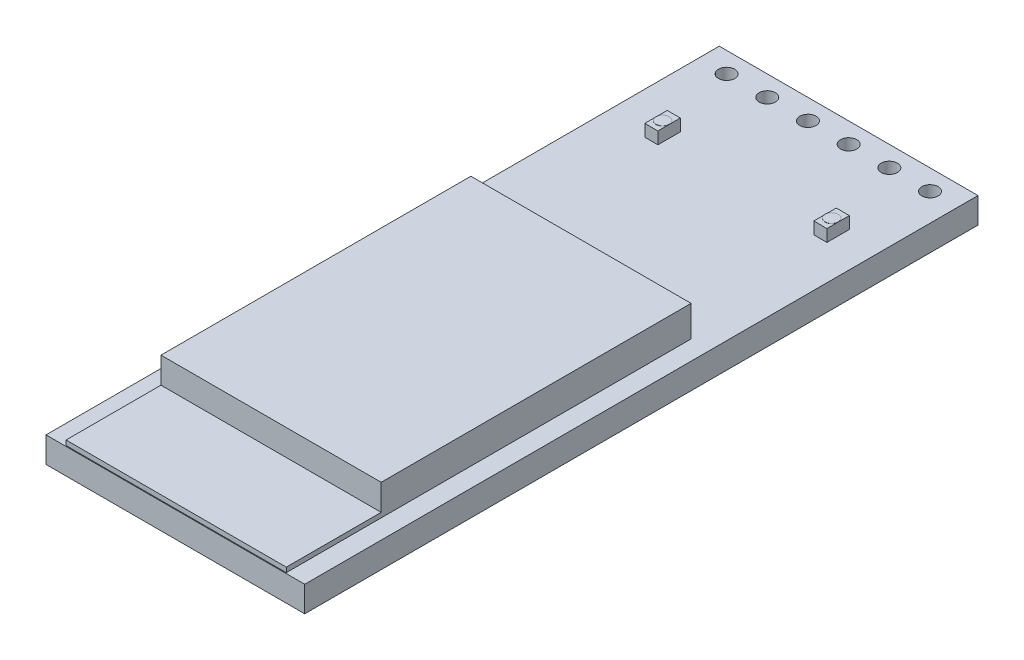
ISO-10303-21;
HEADER;
FILE_DESCRIPTION(('STEP AP214'),'2;1');
FILE_NAME('part.step','',(''),(''),'','','');
FILE_SCHEMA(('AUTOMOTIVE_DESIGN { 1 0 10303 214 1 1 1 1 }'));
ENDSEC;
DATA;
#1=APPLICATION_CONTEXT('core data for automotive mechanical design processes');
#2=APPLICATION_PROTOCOL_DEFINITION('international standard','automotive_design',2000,#1);
#3=PRODUCT_CONTEXT('',#1,'mechanical');
#4=PRODUCT('Part','Part','',(#3));
#5=PRODUCT_RELATED_PRODUCT_CATEGORY('part','',(#4));
#6=PRODUCT_DEFINITION_FORMATION('','',#4);
#7=PRODUCT_DEFINITION_CONTEXT('part definition',#1,'design');
#8=PRODUCT_DEFINITION('design','',#6,#7);
#9=PRODUCT_DEFINITION_SHAPE('','',#8);
#10=(LENGTH_UNIT() NAMED_UNIT(*) SI_UNIT(.MILLI.,.METRE.));
#11=(NAMED_UNIT(*) PLANE_ANGLE_UNIT() SI_UNIT($,.RADIAN.));
#12=(NAMED_UNIT(*) SI_UNIT($,.STERADIAN.) SOLID_ANGLE_UNIT());
#13=UNCERTAINTY_MEASURE_WITH_UNIT(LENGTH_MEASURE(1.E-05),#10,'distance_accuracy_value','');
#14=(GEOMETRIC_REPRESENTATION_CONTEXT(3) GLOBAL_UNCERTAINTY_ASSIGNED_CONTEXT((#13)) GLOBAL_UNIT_ASSIGNED_CONTEXT((#10,
#11,#12)) REPRESENTATION_CONTEXT('',''));
#15=CARTESIAN_POINT('',(0.,0.,0.));
#16=DIRECTION('',(0.,0.,1.));
#17=DIRECTION('',(1.,0.,0.));
#18=AXIS2_PLACEMENT_3D('',#15,#16,#17);
#19=CARTESIAN_POINT('',(-35.1697638099961,1.5501,0.));
#20=DIRECTION('',(0.,1.,0.));
#21=DIRECTION('',(0.,0.,1.));
#22=AXIS2_PLACEMENT_3D('',#19,#20,#21);
#23=PLANE('',#22);
#24=CARTESIAN_POINT('',(5.48720000000001,1.5501,-14.4685));
#25=DIRECTION('',(0.,1.,0.));
#26=DIRECTION('',(0.,0.,1.));
#27=AXIS2_PLACEMENT_3D('',#24,#25,#26);
#28=CIRCLE('',#27,0.409999999999999);
#29=CARTESIAN_POINT('',(5.89720000000001,1.5501,-14.4685));
#30=VERTEX_POINT('',#29);
#31=CARTESIAN_POINT('',(5.0772,1.5501,-14.4685));
#32=VERTEX_POINT('',#31);
#33=EDGE_CURVE('E48',#30,#32,#28,.T.);
#34=ORIENTED_EDGE('',*,*,#33,.F.);
#35=DIRECTION('',(0.,0.,1.));
#36=VECTOR('',#35,1.);
#37=CARTESIAN_POINT('',(5.89720000000001,1.5501,0.));
#38=LINE('',#37,#36);
#39=CARTESIAN_POINT('',(5.89720000000001,1.5501,-15.1685));
#40=VERTEX_POINT('',#39);
#41=EDGE_CURVE('E175',#40,#30,#38,.T.);
#42=ORIENTED_EDGE('',*,*,#41,.F.);
#43=DIRECTION('',(1.,0.,0.));
#44=VECTOR('',#43,1.);
#45=CARTESIAN_POINT('',(-35.1697638099961,1.5501,-15.1685));
#46=LINE('',#45,#44);
#47=CARTESIAN_POINT('',(5.07720000000001,1.5501,-15.1685));
#48=VERTEX_POINT('',#47);
#49=EDGE_CURVE('E185',#48,#40,#46,.T.);
#50=ORIENTED_EDGE('',*,*,#49,.F.);
#51=DIRECTION('',(0.,0.,1.));
#52=VECTOR('',#51,1.);
#53=CARTESIAN_POINT('',(5.0772,1.5501,0.));
#54=LINE('',#53,#52);
#55=EDGE_CURVE('E195',#48,#32,#54,.T.);
#56=ORIENTED_EDGE('',*,*,#55,.T.);
#57=EDGE_LOOP('',(#34,#42,#50,#56));
#58=FACE_BOUND('',#57,.T.);
#59=ADVANCED_FACE('F37',(#58),#23,.T.);
#60=CARTESIAN_POINT('',(-35.1697638099961,1.5501,0.));
#61=DIRECTION('',(0.,1.,0.));
#62=DIRECTION('',(0.,0.,1.));
#63=AXIS2_PLACEMENT_3D('',#60,#61,#62);
#64=PLANE('',#63);
#65=CARTESIAN_POINT('',(-5.06720000000002,1.5501,-14.4685));
#66=DIRECTION('',(0.,1.,0.));
#67=DIRECTION('',(0.,0.,1.));
#68=AXIS2_PLACEMENT_3D('',#65,#66,#67);
#69=CIRCLE('',#68,0.410000000000002);
#70=CARTESIAN_POINT('',(-4.65720000000001,1.5501,-14.4685));
#71=VERTEX_POINT('',#70);
#72=CARTESIAN_POINT('',(-5.47720000000002,1.5501,-14.4685));
#73=VERTEX_POINT('',#72);
#74=EDGE_CURVE('E554',#71,#73,#69,.T.);
#75=ORIENTED_EDGE('',*,*,#74,.F.);
#76=DIRECTION('',(0.,0.,1.));
#77=VECTOR('',#76,1.);
#78=CARTESIAN_POINT('',(-4.65720000000001,1.5501,0.));
#79=LINE('',#78,#77);
#80=CARTESIAN_POINT('',(-4.65720000000001,1.5501,-15.1685));
#81=VERTEX_POINT('',#80);
#82=EDGE_CURVE('E530',#81,#71,#79,.T.);
#83=ORIENTED_EDGE('',*,*,#82,.F.);
#84=DIRECTION('',(1.,0.,0.));
#85=VECTOR('',#84,1.);
#86=CARTESIAN_POINT('',(-35.1697638099961,1.5501,-15.1685));
#87=LINE('',#86,#85);
#88=CARTESIAN_POINT('',(-5.47720000000001,1.5501,-15.1685));
#89=VERTEX_POINT('',#88);
#90=EDGE_CURVE('E527',#89,#81,#87,.T.);
#91=ORIENTED_EDGE('',*,*,#90,.F.);
#92=DIRECTION('',(0.,0.,1.));
#93=VECTOR('',#92,1.);
#94=CARTESIAN_POINT('',(-5.47720000000003,1.5501,0.));
#95=LINE('',#94,#93);
#96=EDGE_CURVE('E523',#89,#73,#95,.T.);
#97=ORIENTED_EDGE('',*,*,#96,.T.);
#98=EDGE_LOOP('',(#75,#83,#91,#97));
#99=FACE_BOUND('',#98,.T.);
#100=ADVANCED_FACE('F215',(#99),#64,.T.);
#101=CARTESIAN_POINT('',(8.07720000000002,0.8001,21.0185));
#102=DIRECTION('',(0.,1.,0.));
#103=DIRECTION('',(0.,0.,1.));
#104=AXIS2_PLACEMENT_3D('',#101,#102,#103);
#105=PLANE('',#104);
#106=DIRECTION('',(0.,0.,1.));
#107=VECTOR('',#106,1.);
#108=CARTESIAN_POINT('',(5.89720000000001,0.8001,0.));
#109=LINE('',#108,#107);
#110=CARTESIAN_POINT('',(5.89720000000001,0.8001,-15.1685));
#111=VERTEX_POINT('',#110);
#112=CARTESIAN_POINT('',(5.89720000000001,0.8001,-13.7685));
#113=VERTEX_POINT('',#112);
#114=EDGE_CURVE('E546',#111,#113,#109,.T.);
#115=ORIENTED_EDGE('',*,*,#114,.T.);
#116=DIRECTION('',(1.,0.,0.));
#117=VECTOR('',#116,1.);
#118=CARTESIAN_POINT('',(-35.1697638099961,0.8001,-13.7684999999999));
#119=LINE('',#118,#117);
#120=CARTESIAN_POINT('',(5.0772,0.8001,-13.7685));
#121=VERTEX_POINT('',#120);
#122=EDGE_CURVE('E191',#121,#113,#119,.T.);
#123=ORIENTED_EDGE('',*,*,#122,.F.);
#124=DIRECTION('',(0.,0.,1.));
#125=VECTOR('',#124,1.);
#126=CARTESIAN_POINT('',(5.0772,0.8001,0.));
#127=LINE('',#126,#125);
#128=CARTESIAN_POINT('',(5.07720000000001,0.8001,-15.1685));
#129=VERTEX_POINT('',#128);
#130=EDGE_CURVE('E540',#129,#121,#127,.T.);
#131=ORIENTED_EDGE('',*,*,#130,.F.);
#132=DIRECTION('',(1.,0.,0.));
#133=VECTOR('',#132,1.);
#134=CARTESIAN_POINT('',(-35.1697638099961,0.8001,-15.1685));
#135=LINE('',#134,#133);
#136=EDGE_CURVE('E543',#129,#111,#135,.T.);
#137=ORIENTED_EDGE('',*,*,#136,.T.);
#138=EDGE_LOOP('',(#115,#123,#131,#137));
#139=FACE_BOUND('',#138,.T.);
#140=DIRECTION('',(0.,0.,1.));
#141=VECTOR('',#140,1.);
#142=CARTESIAN_POINT('',(-4.65720000000001,0.8001,0.));
#143=LINE('',#142,#141);
#144=CARTESIAN_POINT('',(-4.65720000000001,0.8001,-15.1685));
#145=VERTEX_POINT('',#144);
#146=CARTESIAN_POINT('',(-4.65720000000001,0.8001,-13.7685));
#147=VERTEX_POINT('',#146);
#148=EDGE_CURVE('E518',#145,#147,#143,.T.);
#149=ORIENTED_EDGE('',*,*,#148,.T.);
#150=DIRECTION('',(1.,0.,0.));
#151=VECTOR('',#150,1.);
#152=CARTESIAN_POINT('',(-35.1697638099961,0.8001,-13.7685));
#153=LINE('',#152,#151);
#154=CARTESIAN_POINT('',(-5.47720000000002,0.8001,-13.7685));
#155=VERTEX_POINT('',#154);
#156=EDGE_CURVE('E508',#155,#147,#153,.T.);
#157=ORIENTED_EDGE('',*,*,#156,.F.);
#158=DIRECTION('',(0.,0.,1.));
#159=VECTOR('',#158,1.);
#160=CARTESIAN_POINT('',(-5.47720000000003,0.8001,0.));
#161=LINE('',#160,#159);
#162=CARTESIAN_POINT('',(-5.47720000000001,0.8001,-15.1685));
#163=VERTEX_POINT('',#162);
#164=EDGE_CURVE('E512',#163,#155,#161,.T.);
#165=ORIENTED_EDGE('',*,*,#164,.F.);
#166=DIRECTION('',(1.,0.,0.));
#167=VECTOR('',#166,1.);
#168=CARTESIAN_POINT('',(-35.1697638099961,0.8001,-15.1685));
#169=LINE('',#168,#167);
#170=EDGE_CURVE('E515',#163,#145,#169,.T.);
#171=ORIENTED_EDGE('',*,*,#170,.T.);
#172=EDGE_LOOP('',(#149,#157,#165,#171));
#173=FACE_BOUND('',#172,.T.);
#174=DIRECTION('',(0.,0.,-1.));
#175=VECTOR('',#174,1.);
#176=CARTESIAN_POINT('',(8.07720000000002,0.8001,-21.0185));
#177=LINE('',#176,#175);
#178=CARTESIAN_POINT('',(8.07720000000002,0.8001,21.0185));
#179=VERTEX_POINT('',#178);
#180=CARTESIAN_POINT('',(8.07720000000002,0.8001,-21.0185));
#181=VERTEX_POINT('',#180);
#182=EDGE_CURVE('E363',#179,#181,#177,.T.);
#183=ORIENTED_EDGE('',*,*,#182,.T.);
#184=DIRECTION('',(-1.,0.,0.));
#185=VECTOR('',#184,1.);
#186=CARTESIAN_POINT('',(-8.07720000000002,0.8001,-21.0185));
#187=LINE('',#186,#185);
#188=CARTESIAN_POINT('',(-8.07720000000002,0.8001,-21.0185));
#189=VERTEX_POINT('',#188);
#190=EDGE_CURVE('E445',#181,#189,#187,.T.);
#191=ORIENTED_EDGE('',*,*,#190,.T.);
#192=DIRECTION('',(0.,0.,1.));
#193=VECTOR('',#192,1.);
#194=CARTESIAN_POINT('',(-8.07720000000002,0.8001,-21.0185));
#195=LINE('',#194,#193);
#196=CARTESIAN_POINT('',(-8.07720000000002,0.8001,21.0185));
#197=VERTEX_POINT('',#196);
#198=EDGE_CURVE('E357',#189,#197,#195,.T.);
#199=ORIENTED_EDGE('',*,*,#198,.T.);
#200=DIRECTION('',(1.,0.,0.));
#201=VECTOR('',#200,1.);
#202=CARTESIAN_POINT('',(-8.07720000000002,0.8001,21.0185));
#203=LINE('',#202,#201);
#204=EDGE_CURVE('E370',#197,#179,#203,.T.);
#205=ORIENTED_EDGE('',*,*,#204,.T.);
#206=EDGE_LOOP('',(#183,#191,#199,#205));
#207=FACE_BOUND('',#206,.T.);
#208=CARTESIAN_POINT('',(-6.35,0.8001,-19.7485));
#209=DIRECTION('',(0.,1.,0.));
#210=DIRECTION('',(0.,0.,1.));
#211=AXIS2_PLACEMENT_3D('',#208,#209,#210);
#212=CIRCLE('',#211,0.508000000000001);
#213=CARTESIAN_POINT('',(-6.35,0.8001,-19.2405));
#214=VERTEX_POINT('',#213);
#215=EDGE_CURVE('E435',#214,#214,#212,.T.);
#216=ORIENTED_EDGE('',*,*,#215,.F.);
#217=EDGE_LOOP('',(#216));
#218=FACE_BOUND('',#217,.T.);
#219=CARTESIAN_POINT('',(-3.81,0.8001,-19.7485));
#220=DIRECTION('',(0.,1.,0.));
#221=DIRECTION('',(0.,0.,1.));
#222=AXIS2_PLACEMENT_3D('',#219,#220,#221);
#223=CIRCLE('',#222,0.508);
#224=CARTESIAN_POINT('',(-3.81,0.8001,-19.2405));
#225=VERTEX_POINT('',#224);
#226=EDGE_CURVE('E429',#225,#225,#223,.T.);
#227=ORIENTED_EDGE('',*,*,#226,.F.);
#228=EDGE_LOOP('',(#227));
#229=FACE_BOUND('',#228,.T.);
#230=CARTESIAN_POINT('',(-1.27,0.8001,-19.7485));
#231=DIRECTION('',(0.,1.,0.));
#232=DIRECTION('',(0.,0.,1.));
#233=AXIS2_PLACEMENT_3D('',#230,#231,#232);
#234=CIRCLE('',#233,0.508);
#235=CARTESIAN_POINT('',(-1.27,0.8001,-19.2405));
#236=VERTEX_POINT('',#235);
#237=EDGE_CURVE('E423',#236,#236,#234,.T.);
#238=ORIENTED_EDGE('',*,*,#237,.F.);
#239=EDGE_LOOP('',(#238));
#240=FACE_BOUND('',#239,.T.);
#241=CARTESIAN_POINT('',(1.27,0.8001,-19.7485));
#242=DIRECTION('',(0.,1.,0.));
#243=DIRECTION('',(0.,0.,1.));
#244=AXIS2_PLACEMENT_3D('',#241,#242,#243);
#245=CIRCLE('',#244,0.508);
#246=CARTESIAN_POINT('',(1.27,0.8001,-19.2405));
#247=VERTEX_POINT('',#246);
#248=EDGE_CURVE('E417',#247,#247,#245,.T.);
#249=ORIENTED_EDGE('',*,*,#248,.F.);
#250=EDGE_LOOP('',(#249));
#251=FACE_BOUND('',#250,.T.);
#252=CARTESIAN_POINT('',(3.81,0.8001,-19.7485));
#253=DIRECTION('',(0.,1.,0.));
#254=DIRECTION('',(0.,0.,1.));
#255=AXIS2_PLACEMENT_3D('',#252,#253,#254);
#256=CIRCLE('',#255,0.508000000000001);
#257=CARTESIAN_POINT('',(3.81,0.8001,-19.2405));
#258=VERTEX_POINT('',#257);
#259=EDGE_CURVE('E411',#258,#258,#256,.T.);
#260=ORIENTED_EDGE('',*,*,#259,.F.);
#261=EDGE_LOOP('',(#260));
#262=FACE_BOUND('',#261,.T.);
#263=CARTESIAN_POINT('',(6.35,0.8001,-19.7485));
#264=DIRECTION('',(0.,1.,0.));
#265=DIRECTION('',(0.,0.,1.));
#266=AXIS2_PLACEMENT_3D('',#263,#264,#265);
#267=CIRCLE('',#266,0.508000000000001);
#268=CARTESIAN_POINT('',(6.35,0.8001,-19.2405));
#269=VERTEX_POINT('',#268);
#270=EDGE_CURVE('E407',#269,#269,#267,.T.);
#271=ORIENTED_EDGE('',*,*,#270,.F.);
#272=EDGE_LOOP('',(#271));
#273=FACE_BOUND('',#272,.T.);
#274=DIRECTION('',(0.,0.,1.));
#275=VECTOR('',#274,1.);
#276=CARTESIAN_POINT('',(6.875,0.8001,0.));
#277=LINE('',#276,#275);
#278=CARTESIAN_POINT('',(6.875,0.8001,-4.30650000000001));
#279=VERTEX_POINT('',#278);
#280=CARTESIAN_POINT('',(6.875,0.8001,20.9685));
#281=VERTEX_POINT('',#280);
#282=EDGE_CURVE('E388',#279,#281,#277,.T.);
#283=ORIENTED_EDGE('',*,*,#282,.T.);
#284=DIRECTION('',(1.,0.,0.));
#285=VECTOR('',#284,1.);
#286=CARTESIAN_POINT('',(-35.1697638099961,0.8001,20.9685));
#287=LINE('',#286,#285);
#288=CARTESIAN_POINT('',(-6.875,0.8001,20.9685));
#289=VERTEX_POINT('',#288);
#290=EDGE_CURVE('E385',#289,#281,#287,.T.);
#291=ORIENTED_EDGE('',*,*,#290,.F.);
#292=DIRECTION('',(0.,0.,1.));
#293=VECTOR('',#292,1.);
#294=CARTESIAN_POINT('',(-6.875,0.8001,0.));
#295=LINE('',#294,#293);
#296=CARTESIAN_POINT('',(-6.875,0.8001,-4.30650000000001));
#297=VERTEX_POINT('',#296);
#298=EDGE_CURVE('E395',#297,#289,#295,.T.);
#299=ORIENTED_EDGE('',*,*,#298,.F.);
#300=DIRECTION('',(1.,0.,0.));
#301=VECTOR('',#300,1.);
#302=CARTESIAN_POINT('',(-35.1697638099961,0.8001,-4.3065));
#303=LINE('',#302,#301);
#304=EDGE_CURVE('E392',#297,#279,#303,.T.);
#305=ORIENTED_EDGE('',*,*,#304,.T.);
#306=EDGE_LOOP('',(#283,#291,#299,#305));
#307=FACE_BOUND('',#306,.T.);
#308=ADVANCED_FACE('F221',(#139,#173,#207,#218,#229,#240,#251,#262,#273,#307),#105,.T.);
#309=CARTESIAN_POINT('',(8.07720000000002,0.8001,-21.0185));
#310=DIRECTION('',(-1.,0.,0.));
#311=DIRECTION('',(0.,0.,1.));
#312=AXIS2_PLACEMENT_3D('',#309,#310,#311);
#313=PLANE('',#312);
#314=DIRECTION('',(0.,0.,-1.));
#315=VECTOR('',#314,1.);
#316=CARTESIAN_POINT('',(8.07720000000002,-0.8001,-21.0185));
#317=LINE('',#316,#315);
#318=CARTESIAN_POINT('',(8.07720000000002,-0.8001,21.0185));
#319=VERTEX_POINT('',#318);
#320=CARTESIAN_POINT('',(8.07720000000002,-0.8001,-21.0185));
#321=VERTEX_POINT('',#320);
#322=EDGE_CURVE('E353',#319,#321,#317,.T.);
#323=ORIENTED_EDGE('',*,*,#322,.T.);
#324=DIRECTION('',(0.,-1.,0.));
#325=VECTOR('',#324,1.);
#326=CARTESIAN_POINT('',(8.07720000000002,0.8001,-21.0185));
#327=LINE('',#326,#325);
#328=EDGE_CURVE('E347',#181,#321,#327,.T.);
#329=ORIENTED_EDGE('',*,*,#328,.F.);
#330=ORIENTED_EDGE('',*,*,#182,.F.);
#331=DIRECTION('',(0.,-1.,0.));
#332=VECTOR('',#331,1.);
#333=CARTESIAN_POINT('',(8.07720000000002,0.8001,21.0185));
#334=LINE('',#333,#332);
#335=EDGE_CURVE('E367',#179,#319,#334,.T.);
#336=ORIENTED_EDGE('',*,*,#335,.T.);
#337=EDGE_LOOP('',(#323,#329,#330,#336));
#338=FACE_BOUND('',#337,.T.);
#339=ADVANCED_FACE('F39',(#338),#313,.F.);
#340=CARTESIAN_POINT('',(-8.07720000000002,0.8001,-21.0185));
#341=DIRECTION('',(0.,0.,1.));
#342=DIRECTION('',(1.,0.,0.));
#343=AXIS2_PLACEMENT_3D('',#340,#341,#342);
#344=PLANE('',#343);
#345=DIRECTION('',(-1.,0.,0.));
#346=VECTOR('',#345,1.);
#347=CARTESIAN_POINT('',(-8.07720000000002,-0.8001,-21.0185));
#348=LINE('',#347,#346);
#349=CARTESIAN_POINT('',(-8.07720000000002,-0.8001,-21.0185));
#350=VERTEX_POINT('',#349);
#351=EDGE_CURVE('E342',#321,#350,#348,.T.);
#352=ORIENTED_EDGE('',*,*,#351,.T.);
#353=DIRECTION('',(0.,-1.,0.));
#354=VECTOR('',#353,1.);
#355=CARTESIAN_POINT('',(-8.07720000000002,0.8001,-21.0185));
#356=LINE('',#355,#354);
#357=EDGE_CURVE('E344',#189,#350,#356,.T.);
#358=ORIENTED_EDGE('',*,*,#357,.F.);
#359=ORIENTED_EDGE('',*,*,#190,.F.);
#360=ORIENTED_EDGE('',*,*,#328,.T.);
#361=EDGE_LOOP('',(#352,#358,#359,#360));
#362=FACE_BOUND('',#361,.T.);
#363=ADVANCED_FACE('F332',(#362),#344,.F.);
#364=CARTESIAN_POINT('',(-8.07720000000002,0.8001,-21.0185));
#365=DIRECTION('',(1.,0.,0.));
#366=DIRECTION('',(0.,0.,-1.));
#367=AXIS2_PLACEMENT_3D('',#364,#365,#366);
#368=PLANE('',#367);
#369=DIRECTION('',(0.,0.,1.));
#370=VECTOR('',#369,1.);
#371=CARTESIAN_POINT('',(-8.07720000000002,-0.8001,-21.0185));
#372=LINE('',#371,#370);
#373=CARTESIAN_POINT('',(-8.07720000000002,-0.8001,21.0185));
#374=VERTEX_POINT('',#373);
#375=EDGE_CURVE('E352',#350,#374,#372,.T.);
#376=ORIENTED_EDGE('',*,*,#375,.T.);
#377=DIRECTION('',(0.,-1.,0.));
#378=VECTOR('',#377,1.);
#379=CARTESIAN_POINT('',(-8.07720000000002,0.8001,21.0185));
#380=LINE('',#379,#378);
#381=EDGE_CURVE('E358',#197,#374,#380,.T.);
#382=ORIENTED_EDGE('',*,*,#381,.F.);
#383=ORIENTED_EDGE('',*,*,#198,.F.);
#384=ORIENTED_EDGE('',*,*,#357,.T.);
#385=EDGE_LOOP('',(#376,#382,#383,#384));
#386=FACE_BOUND('',#385,.T.);
#387=ADVANCED_FACE('F329',(#386),#368,.F.);
#388=CARTESIAN_POINT('',(-8.07720000000002,0.8001,21.0185));
#389=DIRECTION('',(0.,0.,-1.));
#390=DIRECTION('',(-1.,0.,0.));
#391=AXIS2_PLACEMENT_3D('',#388,#389,#390);
#392=PLANE('',#391);
#393=DIRECTION('',(1.,0.,0.));
#394=VECTOR('',#393,1.);
#395=CARTESIAN_POINT('',(-8.07720000000002,-0.8001,21.0185));
#396=LINE('',#395,#394);
#397=EDGE_CURVE('E361',#374,#319,#396,.T.);
#398=ORIENTED_EDGE('',*,*,#397,.T.);
#399=ORIENTED_EDGE('',*,*,#335,.F.);
#400=ORIENTED_EDGE('',*,*,#204,.F.);
#401=ORIENTED_EDGE('',*,*,#381,.T.);
#402=EDGE_LOOP('',(#398,#399,#400,#401));
#403=FACE_BOUND('',#402,.T.);
#404=ADVANCED_FACE('F325',(#403),#392,.F.);
#405=CARTESIAN_POINT('',(8.07720000000002,-0.8001,21.0185));
#406=DIRECTION('',(0.,1.,0.));
#407=DIRECTION('',(0.,0.,1.));
#408=AXIS2_PLACEMENT_3D('',#405,#406,#407);
#409=PLANE('',#408);
#410=CARTESIAN_POINT('',(6.35,-0.8001,-19.7485));
#411=DIRECTION('',(0.,1.,0.));
#412=DIRECTION('',(0.,0.,1.));
#413=AXIS2_PLACEMENT_3D('',#410,#411,#412);
#414=CIRCLE('',#413,0.508000000000001);
#415=CARTESIAN_POINT('',(6.35,-0.8001,-19.2405));
#416=VERTEX_POINT('',#415);
#417=EDGE_CURVE('E408',#416,#416,#414,.T.);
#418=ORIENTED_EDGE('',*,*,#417,.T.);
#419=EDGE_LOOP('',(#418));
#420=FACE_BOUND('',#419,.T.);
#421=CARTESIAN_POINT('',(3.81,-0.8001,-19.7485));
#422=DIRECTION('',(0.,1.,0.));
#423=DIRECTION('',(0.,0.,1.));
#424=AXIS2_PLACEMENT_3D('',#421,#422,#423);
#425=CIRCLE('',#424,0.508000000000001);
#426=CARTESIAN_POINT('',(3.81,-0.8001,-19.2405));
#427=VERTEX_POINT('',#426);
#428=EDGE_CURVE('E414',#427,#427,#425,.T.);
#429=ORIENTED_EDGE('',*,*,#428,.T.);
#430=EDGE_LOOP('',(#429));
#431=FACE_BOUND('',#430,.T.);
#432=CARTESIAN_POINT('',(1.27,-0.8001,-19.7485));
#433=DIRECTION('',(0.,1.,0.));
#434=DIRECTION('',(0.,0.,1.));
#435=AXIS2_PLACEMENT_3D('',#432,#433,#434);
#436=CIRCLE('',#435,0.508);
#437=CARTESIAN_POINT('',(1.27,-0.8001,-19.2405));
#438=VERTEX_POINT('',#437);
#439=EDGE_CURVE('E420',#438,#438,#436,.T.);
#440=ORIENTED_EDGE('',*,*,#439,.T.);
#441=EDGE_LOOP('',(#440));
#442=FACE_BOUND('',#441,.T.);
#443=CARTESIAN_POINT('',(-1.27,-0.8001,-19.7485));
#444=DIRECTION('',(0.,1.,0.));
#445=DIRECTION('',(0.,0.,1.));
#446=AXIS2_PLACEMENT_3D('',#443,#444,#445);
#447=CIRCLE('',#446,0.508);
#448=CARTESIAN_POINT('',(-1.27,-0.8001,-19.2405));
#449=VERTEX_POINT('',#448);
#450=EDGE_CURVE('E426',#449,#449,#447,.T.);
#451=ORIENTED_EDGE('',*,*,#450,.T.);
#452=EDGE_LOOP('',(#451));
#453=FACE_BOUND('',#452,.T.);
#454=CARTESIAN_POINT('',(-3.81,-0.8001,-19.7485));
#455=DIRECTION('',(0.,1.,0.));
#456=DIRECTION('',(0.,0.,1.));
#457=AXIS2_PLACEMENT_3D('',#454,#455,#456);
#458=CIRCLE('',#457,0.508);
#459=CARTESIAN_POINT('',(-3.81,-0.8001,-19.2405));
#460=VERTEX_POINT('',#459);
#461=EDGE_CURVE('E432',#460,#460,#458,.T.);
#462=ORIENTED_EDGE('',*,*,#461,.T.);
#463=EDGE_LOOP('',(#462));
#464=FACE_BOUND('',#463,.T.);
#465=CARTESIAN_POINT('',(-6.35,-0.8001,-19.7485));
#466=DIRECTION('',(0.,1.,0.));
#467=DIRECTION('',(0.,0.,1.));
#468=AXIS2_PLACEMENT_3D('',#465,#466,#467);
#469=CIRCLE('',#468,0.508000000000001);
#470=CARTESIAN_POINT('',(-6.35,-0.8001,-19.2405));
#471=VERTEX_POINT('',#470);
#472=EDGE_CURVE('E438',#471,#471,#469,.T.);
#473=ORIENTED_EDGE('',*,*,#472,.T.);
#474=EDGE_LOOP('',(#473));
#475=FACE_BOUND('',#474,.T.);
#476=ORIENTED_EDGE('',*,*,#322,.F.);
#477=ORIENTED_EDGE('',*,*,#397,.F.);
#478=ORIENTED_EDGE('',*,*,#375,.F.);
#479=ORIENTED_EDGE('',*,*,#351,.F.);
#480=EDGE_LOOP('',(#476,#477,#478,#479));
#481=FACE_BOUND('',#480,.T.);
#482=ADVANCED_FACE('F318',(#420,#431,#442,#453,#464,#475,#481),#409,.F.);
#483=CARTESIAN_POINT('',(-6.35,-0.8001,-19.7485));
#484=DIRECTION('',(0.,1.,0.));
#485=DIRECTION('',(0.,0.,1.));
#486=AXIS2_PLACEMENT_3D('',#483,#484,#485);
#487=CYLINDRICAL_SURFACE('',#486,0.508000000000001);
#488=ORIENTED_EDGE('',*,*,#472,.F.);
#489=EDGE_LOOP('',(#488));
#490=FACE_BOUND('',#489,.T.);
#491=ORIENTED_EDGE('',*,*,#215,.T.);
#492=EDGE_LOOP('',(#491));
#493=FACE_BOUND('',#492,.T.);
#494=ADVANCED_FACE('F314',(#490,#493),#487,.F.);
#495=CARTESIAN_POINT('',(-3.81,-0.8001,-19.7485));
#496=DIRECTION('',(0.,1.,0.));
#497=DIRECTION('',(0.,0.,1.));
#498=AXIS2_PLACEMENT_3D('',#495,#496,#497);
#499=CYLINDRICAL_SURFACE('',#498,0.508);
#500=ORIENTED_EDGE('',*,*,#461,.F.);
#501=EDGE_LOOP('',(#500));
#502=FACE_BOUND('',#501,.T.);
#503=ORIENTED_EDGE('',*,*,#226,.T.);
#504=EDGE_LOOP('',(#503));
#505=FACE_BOUND('',#504,.T.);
#506=ADVANCED_FACE('F310',(#502,#505),#499,.F.);
#507=CARTESIAN_POINT('',(-1.27,-0.8001,-19.7485));
#508=DIRECTION('',(0.,1.,0.));
#509=DIRECTION('',(0.,0.,1.));
#510=AXIS2_PLACEMENT_3D('',#507,#508,#509);
#511=CYLINDRICAL_SURFACE('',#510,0.508);
#512=ORIENTED_EDGE('',*,*,#450,.F.);
#513=EDGE_LOOP('',(#512));
#514=FACE_BOUND('',#513,.T.);
#515=ORIENTED_EDGE('',*,*,#237,.T.);
#516=EDGE_LOOP('',(#515));
#517=FACE_BOUND('',#516,.T.);
#518=ADVANCED_FACE('F306',(#514,#517),#511,.F.);
#519=CARTESIAN_POINT('',(1.27,-0.8001,-19.7485));
#520=DIRECTION('',(0.,1.,0.));
#521=DIRECTION('',(0.,0.,1.));
#522=AXIS2_PLACEMENT_3D('',#519,#520,#521);
#523=CYLINDRICAL_SURFACE('',#522,0.508);
#524=ORIENTED_EDGE('',*,*,#439,.F.);
#525=EDGE_LOOP('',(#524));
#526=FACE_BOUND('',#525,.T.);
#527=ORIENTED_EDGE('',*,*,#248,.T.);
#528=EDGE_LOOP('',(#527));
#529=FACE_BOUND('',#528,.T.);
#530=ADVANCED_FACE('F302',(#526,#529),#523,.F.);
#531=CARTESIAN_POINT('',(3.81,-0.8001,-19.7485));
#532=DIRECTION('',(0.,1.,0.));
#533=DIRECTION('',(0.,0.,1.));
#534=AXIS2_PLACEMENT_3D('',#531,#532,#533);
#535=CYLINDRICAL_SURFACE('',#534,0.508000000000001);
#536=ORIENTED_EDGE('',*,*,#428,.F.);
#537=EDGE_LOOP('',(#536));
#538=FACE_BOUND('',#537,.T.);
#539=ORIENTED_EDGE('',*,*,#259,.T.);
#540=EDGE_LOOP('',(#539));
#541=FACE_BOUND('',#540,.T.);
#542=ADVANCED_FACE('F298',(#538,#541),#535,.F.);
#543=CARTESIAN_POINT('',(6.35,-0.8001,-19.7485));
#544=DIRECTION('',(0.,1.,0.));
#545=DIRECTION('',(0.,0.,1.));
#546=AXIS2_PLACEMENT_3D('',#543,#544,#545);
#547=CYLINDRICAL_SURFACE('',#546,0.508000000000001);
#548=ORIENTED_EDGE('',*,*,#417,.F.);
#549=EDGE_LOOP('',(#548));
#550=FACE_BOUND('',#549,.T.);
#551=ORIENTED_EDGE('',*,*,#270,.T.);
#552=EDGE_LOOP('',(#551));
#553=FACE_BOUND('',#552,.T.);
#554=ADVANCED_FACE('F294',(#550,#553),#547,.F.);
#555=CARTESIAN_POINT('',(-35.1697638099961,1.1001,20.9685));
#556=DIRECTION('',(0.,0.,-1.));
#557=DIRECTION('',(-1.,0.,0.));
#558=AXIS2_PLACEMENT_3D('',#555,#556,#557);
#559=PLANE('',#558);
#560=ORIENTED_EDGE('',*,*,#290,.T.);
#561=DIRECTION('',(0.,-1.,0.));
#562=VECTOR('',#561,1.);
#563=CARTESIAN_POINT('',(6.875,1.1001,20.9685));
#564=LINE('',#563,#562);
#565=CARTESIAN_POINT('',(6.875,1.1001,20.9685));
#566=VERTEX_POINT('',#565);
#567=EDGE_CURVE('E405',#566,#281,#564,.T.);
#568=ORIENTED_EDGE('',*,*,#567,.F.);
#569=DIRECTION('',(1.,0.,0.));
#570=VECTOR('',#569,1.);
#571=CARTESIAN_POINT('',(-35.1697638099961,1.1001,20.9685));
#572=LINE('',#571,#570);
#573=CARTESIAN_POINT('',(-6.875,1.1001,20.9685));
#574=VERTEX_POINT('',#573);
#575=EDGE_CURVE('E377',#574,#566,#572,.T.);
#576=ORIENTED_EDGE('',*,*,#575,.F.);
#577=DIRECTION('',(0.,-1.,0.));
#578=VECTOR('',#577,1.);
#579=CARTESIAN_POINT('',(-6.875,1.1001,20.9685));
#580=LINE('',#579,#578);
#581=EDGE_CURVE('E397',#574,#289,#580,.T.);
#582=ORIENTED_EDGE('',*,*,#581,.T.);
#583=EDGE_LOOP('',(#560,#568,#576,#582));
#584=FACE_BOUND('',#583,.T.);
#585=ADVANCED_FACE('F290',(#584),#559,.F.);
#586=CARTESIAN_POINT('',(6.875,1.1001,0.));
#587=DIRECTION('',(1.,0.,0.));
#588=DIRECTION('',(0.,0.,-1.));
#589=AXIS2_PLACEMENT_3D('',#586,#587,#588);
#590=PLANE('',#589);
#591=ORIENTED_EDGE('',*,*,#282,.F.);
#592=DIRECTION('',(0.,-1.,0.));
#593=VECTOR('',#592,1.);
#594=CARTESIAN_POINT('',(6.875,1.1001,-4.30650000000001));
#595=LINE('',#594,#593);
#596=CARTESIAN_POINT('',(6.875,2.7251,-4.30650000000001));
#597=VERTEX_POINT('',#596);
#598=EDGE_CURVE('E403',#597,#279,#595,.T.);
#599=ORIENTED_EDGE('',*,*,#598,.F.);
#600=DIRECTION('',(0.,0.,-1.));
#601=VECTOR('',#600,1.);
#602=CARTESIAN_POINT('',(6.875,2.7251,8.33099999999999));
#603=LINE('',#602,#601);
#604=CARTESIAN_POINT('',(6.875,2.7251,15.0435));
#605=VERTEX_POINT('',#604);
#606=EDGE_CURVE('E484',#605,#597,#603,.T.);
#607=ORIENTED_EDGE('',*,*,#606,.F.);
#608=DIRECTION('',(0.,-1.,0.));
#609=VECTOR('',#608,1.);
#610=CARTESIAN_POINT('',(6.875,2.7251,15.0435));
#611=LINE('',#610,#609);
#612=CARTESIAN_POINT('',(6.875,1.1001,15.0435));
#613=VERTEX_POINT('',#612);
#614=EDGE_CURVE('E485',#605,#613,#611,.T.);
#615=ORIENTED_EDGE('',*,*,#614,.T.);
#616=DIRECTION('',(0.,0.,1.));
#617=VECTOR('',#616,1.);
#618=CARTESIAN_POINT('',(6.875,1.1001,0.));
#619=LINE('',#618,#617);
#620=EDGE_CURVE('E373',#613,#566,#619,.T.);
#621=ORIENTED_EDGE('',*,*,#620,.T.);
#622=ORIENTED_EDGE('',*,*,#567,.T.);
#623=EDGE_LOOP('',(#591,#599,#607,#615,#621,#622));
#624=FACE_BOUND('',#623,.T.);
#625=ADVANCED_FACE('F286',(#624),#590,.T.);
#626=CARTESIAN_POINT('',(-35.1697638099961,1.1001,-4.3065));
#627=DIRECTION('',(0.,0.,-1.));
#628=DIRECTION('',(-1.,0.,0.));
#629=AXIS2_PLACEMENT_3D('',#626,#627,#628);
#630=PLANE('',#629);
#631=ORIENTED_EDGE('',*,*,#304,.F.);
#632=DIRECTION('',(0.,-1.,0.));
#633=VECTOR('',#632,1.);
#634=CARTESIAN_POINT('',(-6.875,1.1001,-4.30650000000001));
#635=LINE('',#634,#633);
#636=CARTESIAN_POINT('',(-6.875,2.7251,-4.30650000000001));
#637=VERTEX_POINT('',#636);
#638=EDGE_CURVE('E400',#637,#297,#635,.T.);
#639=ORIENTED_EDGE('',*,*,#638,.F.);
#640=DIRECTION('',(-1.,0.,0.));
#641=VECTOR('',#640,1.);
#642=CARTESIAN_POINT('',(-22.5215982014948,2.7251,-4.3065));
#643=LINE('',#642,#641);
#644=EDGE_CURVE('E483',#597,#637,#643,.T.);
#645=ORIENTED_EDGE('',*,*,#644,.F.);
#646=ORIENTED_EDGE('',*,*,#598,.T.);
#647=EDGE_LOOP('',(#631,#639,#645,#646));
#648=FACE_BOUND('',#647,.T.);
#649=ADVANCED_FACE('F282',(#648),#630,.T.);
#650=CARTESIAN_POINT('',(-6.875,1.1001,0.));
#651=DIRECTION('',(1.,0.,0.));
#652=DIRECTION('',(0.,0.,-1.));
#653=AXIS2_PLACEMENT_3D('',#650,#651,#652);
#654=PLANE('',#653);
#655=ORIENTED_EDGE('',*,*,#298,.T.);
#656=ORIENTED_EDGE('',*,*,#581,.F.);
#657=DIRECTION('',(0.,0.,1.));
#658=VECTOR('',#657,1.);
#659=CARTESIAN_POINT('',(-6.875,1.1001,0.));
#660=LINE('',#659,#658);
#661=CARTESIAN_POINT('',(-6.875,1.1001,15.0435));
#662=VERTEX_POINT('',#661);
#663=EDGE_CURVE('E376',#662,#574,#660,.T.);
#664=ORIENTED_EDGE('',*,*,#663,.F.);
#665=DIRECTION('',(0.,-1.,0.));
#666=VECTOR('',#665,1.);
#667=CARTESIAN_POINT('',(-6.875,2.7251,15.0435));
#668=LINE('',#667,#666);
#669=CARTESIAN_POINT('',(-6.875,2.7251,15.0435));
#670=VERTEX_POINT('',#669);
#671=EDGE_CURVE('E389',#670,#662,#668,.T.);
#672=ORIENTED_EDGE('',*,*,#671,.F.);
#673=DIRECTION('',(0.,0.,1.));
#674=VECTOR('',#673,1.);
#675=CARTESIAN_POINT('',(-6.875,2.7251,8.33099999999999));
#676=LINE('',#675,#674);
#677=EDGE_CURVE('E480',#637,#670,#676,.T.);
#678=ORIENTED_EDGE('',*,*,#677,.F.);
#679=ORIENTED_EDGE('',*,*,#638,.T.);
#680=EDGE_LOOP('',(#655,#656,#664,#672,#678,#679));
#681=FACE_BOUND('',#680,.T.);
#682=ADVANCED_FACE('F278',(#681),#654,.F.);
#683=CARTESIAN_POINT('',(-35.1697638099961,1.1001,0.));
#684=DIRECTION('',(0.,1.,0.));
#685=DIRECTION('',(0.,0.,1.));
#686=AXIS2_PLACEMENT_3D('',#683,#684,#685);
#687=PLANE('',#686);
#688=DIRECTION('',(1.,0.,0.));
#689=VECTOR('',#688,1.);
#690=CARTESIAN_POINT('',(-22.5215982014948,1.1001,15.0435));
#691=LINE('',#690,#689);
#692=EDGE_CURVE('E492',#662,#613,#691,.T.);
#693=ORIENTED_EDGE('',*,*,#692,.F.);
#694=ORIENTED_EDGE('',*,*,#663,.T.);
#695=ORIENTED_EDGE('',*,*,#575,.T.);
#696=ORIENTED_EDGE('',*,*,#620,.F.);
#697=EDGE_LOOP('',(#693,#694,#695,#696));
#698=FACE_BOUND('',#697,.T.);
#699=ADVANCED_FACE('F274',(#698),#687,.T.);
#700=CARTESIAN_POINT('',(-22.5215982014948,2.7251,15.0435));
#701=DIRECTION('',(0.,0.,-1.));
#702=DIRECTION('',(-1.,0.,0.));
#703=AXIS2_PLACEMENT_3D('',#700,#701,#702);
#704=PLANE('',#703);
#705=ORIENTED_EDGE('',*,*,#692,.T.);
#706=ORIENTED_EDGE('',*,*,#614,.F.);
#707=DIRECTION('',(1.,0.,0.));
#708=VECTOR('',#707,1.);
#709=CARTESIAN_POINT('',(-22.5215982014948,2.7251,15.0435));
#710=LINE('',#709,#708);
#711=EDGE_CURVE('E488',#670,#605,#710,.T.);
#712=ORIENTED_EDGE('',*,*,#711,.F.);
#713=ORIENTED_EDGE('',*,*,#671,.T.);
#714=EDGE_LOOP('',(#705,#706,#712,#713));
#715=FACE_BOUND('',#714,.T.);
#716=ADVANCED_FACE('F270',(#715),#704,.F.);
#717=CARTESIAN_POINT('',(-22.5215982014948,2.7251,8.33099999999999));
#718=DIRECTION('',(0.,1.,0.));
#719=DIRECTION('',(0.,0.,1.));
#720=AXIS2_PLACEMENT_3D('',#717,#718,#719);
#721=PLANE('',#720);
#722=ORIENTED_EDGE('',*,*,#677,.T.);
#723=ORIENTED_EDGE('',*,*,#711,.T.);
#724=ORIENTED_EDGE('',*,*,#606,.T.);
#725=ORIENTED_EDGE('',*,*,#644,.T.);
#726=EDGE_LOOP('',(#722,#723,#724,#725));
#727=FACE_BOUND('',#726,.T.);
#728=ADVANCED_FACE('F266',(#727),#721,.T.);
#729=CARTESIAN_POINT('',(-4.65720000000001,1.5501,0.));
#730=DIRECTION('',(1.,0.,0.));
#731=DIRECTION('',(0.,0.,-1.));
#732=AXIS2_PLACEMENT_3D('',#729,#730,#731);
#733=PLANE('',#732);
#734=ORIENTED_EDGE('',*,*,#148,.F.);
#735=DIRECTION('',(0.,-1.,0.));
#736=VECTOR('',#735,1.);
#737=CARTESIAN_POINT('',(-4.65720000000001,1.5501,-15.1685));
#738=LINE('',#737,#736);
#739=EDGE_CURVE('E494',#81,#145,#738,.T.);
#740=ORIENTED_EDGE('',*,*,#739,.F.);
#741=ORIENTED_EDGE('',*,*,#82,.T.);
#742=CARTESIAN_POINT('',(-4.65720000000001,1.5501,-13.7685));
#743=VERTEX_POINT('',#742);
#744=EDGE_CURVE('E511',#71,#743,#79,.T.);
#745=ORIENTED_EDGE('',*,*,#744,.T.);
#746=DIRECTION('',(0.,-1.,0.));
#747=VECTOR('',#746,1.);
#748=CARTESIAN_POINT('',(-4.65720000000001,1.5501,-13.7685));
#749=LINE('',#748,#747);
#750=EDGE_CURVE('E505',#743,#147,#749,.T.);
#751=ORIENTED_EDGE('',*,*,#750,.T.);
#752=EDGE_LOOP('',(#734,#740,#741,#745,#751));
#753=FACE_BOUND('',#752,.T.);
#754=ADVANCED_FACE('F262',(#753),#733,.T.);
#755=CARTESIAN_POINT('',(-35.1697638099961,1.5501,-15.1685));
#756=DIRECTION('',(0.,0.,-1.));
#757=DIRECTION('',(-1.,0.,0.));
#758=AXIS2_PLACEMENT_3D('',#755,#756,#757);
#759=PLANE('',#758);
#760=ORIENTED_EDGE('',*,*,#170,.F.);
#761=DIRECTION('',(0.,-1.,0.));
#762=VECTOR('',#761,1.);
#763=CARTESIAN_POINT('',(-5.47720000000001,1.5501,-15.1685));
#764=LINE('',#763,#762);
#765=EDGE_CURVE('E501',#89,#163,#764,.T.);
#766=ORIENTED_EDGE('',*,*,#765,.F.);
#767=ORIENTED_EDGE('',*,*,#90,.T.);
#768=ORIENTED_EDGE('',*,*,#739,.T.);
#769=EDGE_LOOP('',(#760,#766,#767,#768));
#770=FACE_BOUND('',#769,.T.);
#771=ADVANCED_FACE('F258',(#770),#759,.T.);
#772=CARTESIAN_POINT('',(-5.47720000000003,1.5501,0.));
#773=DIRECTION('',(1.,0.,0.));
#774=DIRECTION('',(0.,0.,-1.));
#775=AXIS2_PLACEMENT_3D('',#772,#773,#774);
#776=PLANE('',#775);
#777=ORIENTED_EDGE('',*,*,#164,.T.);
#778=DIRECTION('',(0.,-1.,0.));
#779=VECTOR('',#778,1.);
#780=CARTESIAN_POINT('',(-5.47720000000002,1.5501,-13.7685));
#781=LINE('',#780,#779);
#782=CARTESIAN_POINT('',(-5.47720000000002,1.5501,-13.7685));
#783=VERTEX_POINT('',#782);
#784=EDGE_CURVE('E503',#783,#155,#781,.T.);
#785=ORIENTED_EDGE('',*,*,#784,.F.);
#786=EDGE_CURVE('E526',#73,#783,#95,.T.);
#787=ORIENTED_EDGE('',*,*,#786,.F.);
#788=ORIENTED_EDGE('',*,*,#96,.F.);
#789=ORIENTED_EDGE('',*,*,#765,.T.);
#790=EDGE_LOOP('',(#777,#785,#787,#788,#789));
#791=FACE_BOUND('',#790,.T.);
#792=ADVANCED_FACE('F254',(#791),#776,.F.);
#793=CARTESIAN_POINT('',(-35.1697638099961,1.5501,-13.7685));
#794=DIRECTION('',(0.,0.,-1.));
#795=DIRECTION('',(-1.,0.,0.));
#796=AXIS2_PLACEMENT_3D('',#793,#794,#795);
#797=PLANE('',#796);
#798=ORIENTED_EDGE('',*,*,#156,.T.);
#799=ORIENTED_EDGE('',*,*,#750,.F.);
#800=DIRECTION('',(1.,0.,0.));
#801=VECTOR('',#800,1.);
#802=CARTESIAN_POINT('',(-35.1697638099961,1.5501,-13.7685));
#803=LINE('',#802,#801);
#804=EDGE_CURVE('E507',#783,#743,#803,.T.);
#805=ORIENTED_EDGE('',*,*,#804,.F.);
#806=ORIENTED_EDGE('',*,*,#784,.T.);
#807=EDGE_LOOP('',(#798,#799,#805,#806));
#808=FACE_BOUND('',#807,.T.);
#809=ADVANCED_FACE('F251',(#808),#797,.F.);
#810=EDGE_CURVE('E46',#73,#71,#69,.T.);
#811=ORIENTED_EDGE('',*,*,#810,.F.);
#812=ORIENTED_EDGE('',*,*,#786,.T.);
#813=ORIENTED_EDGE('',*,*,#804,.T.);
#814=ORIENTED_EDGE('',*,*,#744,.F.);
#815=EDGE_LOOP('',(#811,#812,#813,#814));
#816=FACE_BOUND('',#815,.T.);
#817=ADVANCED_FACE('F224',(#816),#64,.T.);
#818=CARTESIAN_POINT('',(5.89720000000001,1.5501,0.));
#819=DIRECTION('',(1.,0.,0.));
#820=DIRECTION('',(0.,0.,-1.));
#821=AXIS2_PLACEMENT_3D('',#818,#819,#820);
#822=PLANE('',#821);
#823=ORIENTED_EDGE('',*,*,#114,.F.);
#824=DIRECTION('',(0.,-1.,0.));
#825=VECTOR('',#824,1.);
#826=CARTESIAN_POINT('',(5.89720000000001,1.5501,-15.1685));
#827=LINE('',#826,#825);
#828=EDGE_CURVE('E180',#40,#111,#827,.T.);
#829=ORIENTED_EDGE('',*,*,#828,.F.);
#830=ORIENTED_EDGE('',*,*,#41,.T.);
#831=CARTESIAN_POINT('',(5.89720000000001,1.5501,-13.7685));
#832=VERTEX_POINT('',#831);
#833=EDGE_CURVE('E178',#30,#832,#38,.T.);
#834=ORIENTED_EDGE('',*,*,#833,.T.);
#835=DIRECTION('',(0.,-1.,0.));
#836=VECTOR('',#835,1.);
#837=CARTESIAN_POINT('',(5.89720000000001,1.5501,-13.7685));
#838=LINE('',#837,#836);
#839=EDGE_CURVE('E537',#832,#113,#838,.T.);
#840=ORIENTED_EDGE('',*,*,#839,.T.);
#841=EDGE_LOOP('',(#823,#829,#830,#834,#840));
#842=FACE_BOUND('',#841,.T.);
#843=ADVANCED_FACE('F177',(#842),#822,.T.);
#844=CARTESIAN_POINT('',(-35.1697638099961,1.5501,-15.1685));
#845=DIRECTION('',(0.,0.,-1.));
#846=DIRECTION('',(-1.,0.,0.));
#847=AXIS2_PLACEMENT_3D('',#844,#845,#846);
#848=PLANE('',#847);
#849=ORIENTED_EDGE('',*,*,#136,.F.);
#850=DIRECTION('',(0.,-1.,0.));
#851=VECTOR('',#850,1.);
#852=CARTESIAN_POINT('',(5.07720000000001,1.5501,-15.1685));
#853=LINE('',#852,#851);
#854=EDGE_CURVE('E533',#48,#129,#853,.T.);
#855=ORIENTED_EDGE('',*,*,#854,.F.);
#856=ORIENTED_EDGE('',*,*,#49,.T.);
#857=ORIENTED_EDGE('',*,*,#828,.T.);
#858=EDGE_LOOP('',(#849,#855,#856,#857));
#859=FACE_BOUND('',#858,.T.);
#860=ADVANCED_FACE('F241',(#859),#848,.T.);
#861=CARTESIAN_POINT('',(5.0772,1.5501,0.));
#862=DIRECTION('',(1.,0.,0.));
#863=DIRECTION('',(0.,0.,-1.));
#864=AXIS2_PLACEMENT_3D('',#861,#862,#863);
#865=PLANE('',#864);
#866=ORIENTED_EDGE('',*,*,#130,.T.);
#867=DIRECTION('',(0.,-1.,0.));
#868=VECTOR('',#867,1.);
#869=CARTESIAN_POINT('',(5.0772,1.5501,-13.7685));
#870=LINE('',#869,#868);
#871=CARTESIAN_POINT('',(5.0772,1.5501,-13.7685));
#872=VERTEX_POINT('',#871);
#873=EDGE_CURVE('E535',#872,#121,#870,.T.);
#874=ORIENTED_EDGE('',*,*,#873,.F.);
#875=EDGE_CURVE('E552',#32,#872,#54,.T.);
#876=ORIENTED_EDGE('',*,*,#875,.F.);
#877=ORIENTED_EDGE('',*,*,#55,.F.);
#878=ORIENTED_EDGE('',*,*,#854,.T.);
#879=EDGE_LOOP('',(#866,#874,#876,#877,#878));
#880=FACE_BOUND('',#879,.T.);
#881=ADVANCED_FACE('F234',(#880),#865,.F.);
#882=CARTESIAN_POINT('',(-35.1697638099961,1.5501,-13.7684999999999));
#883=DIRECTION('',(0.,0.,-1.));
#884=DIRECTION('',(-1.,0.,0.));
#885=AXIS2_PLACEMENT_3D('',#882,#883,#884);
#886=PLANE('',#885);
#887=ORIENTED_EDGE('',*,*,#122,.T.);
#888=ORIENTED_EDGE('',*,*,#839,.F.);
#889=DIRECTION('',(1.,0.,0.));
#890=VECTOR('',#889,1.);
#891=CARTESIAN_POINT('',(-35.1697638099961,1.5501,-13.7684999999999));
#892=LINE('',#891,#890);
#893=EDGE_CURVE('E189',#872,#832,#892,.T.);
#894=ORIENTED_EDGE('',*,*,#893,.F.);
#895=ORIENTED_EDGE('',*,*,#873,.T.);
#896=EDGE_LOOP('',(#887,#888,#894,#895));
#897=FACE_BOUND('',#896,.T.);
#898=ADVANCED_FACE('F228',(#897),#886,.F.);
#899=EDGE_CURVE('E11',#32,#30,#28,.T.);
#900=ORIENTED_EDGE('',*,*,#899,.F.);
#901=ORIENTED_EDGE('',*,*,#875,.T.);
#902=ORIENTED_EDGE('',*,*,#893,.T.);
#903=ORIENTED_EDGE('',*,*,#833,.F.);
#904=EDGE_LOOP('',(#900,#901,#902,#903));
#905=FACE_BOUND('',#904,.T.);
#906=ADVANCED_FACE('F187',(#905),#23,.T.);
#907=CARTESIAN_POINT('',(-5.06720000000002,1.5601,-14.4685));
#908=DIRECTION('',(0.,-1.,0.));
#909=DIRECTION('',(0.,0.,-1.));
#910=AXIS2_PLACEMENT_3D('',#907,#908,#909);
#911=CYLINDRICAL_SURFACE('',#910,0.410000000000002);
#912=CARTESIAN_POINT('',(-5.06720000000002,1.5601,-14.4685));
#913=DIRECTION('',(0.,1.,0.));
#914=DIRECTION('',(0.,0.,1.));
#915=AXIS2_PLACEMENT_3D('',#912,#913,#914);
#916=CIRCLE('',#915,0.410000000000002);
#917=CARTESIAN_POINT('',(-5.06720000000002,1.5601,-14.0585));
#918=VERTEX_POINT('',#917);
#919=EDGE_CURVE('E549',#918,#918,#916,.T.);
#920=ORIENTED_EDGE('',*,*,#919,.F.);
#921=EDGE_LOOP('',(#920));
#922=FACE_BOUND('',#921,.T.);
#923=ORIENTED_EDGE('',*,*,#74,.T.);
#924=ORIENTED_EDGE('',*,*,#810,.T.);
#925=EDGE_LOOP('',(#923,#924));
#926=FACE_BOUND('',#925,.T.);
#927=ADVANCED_FACE('F210',(#922,#926),#911,.T.);
#928=CARTESIAN_POINT('',(-8.84539185724304,1.5601,-14.4685));
#929=DIRECTION('',(0.,1.,0.));
#930=DIRECTION('',(0.,0.,1.));
#931=AXIS2_PLACEMENT_3D('',#928,#929,#930);
#932=PLANE('',#931);
#933=ORIENTED_EDGE('',*,*,#919,.T.);
#934=EDGE_LOOP('',(#933));
#935=FACE_BOUND('',#934,.T.);
#936=ADVANCED_FACE('F201',(#935),#932,.T.);
#937=CARTESIAN_POINT('',(5.48720000000001,1.5601,-14.4685));
#938=DIRECTION('',(0.,-1.,0.));
#939=DIRECTION('',(0.,0.,-1.));
#940=AXIS2_PLACEMENT_3D('',#937,#938,#939);
#941=CYLINDRICAL_SURFACE('',#940,0.409999999999999);
#942=CARTESIAN_POINT('',(5.48720000000001,1.5601,-14.4685));
#943=DIRECTION('',(0.,1.,0.));
#944=DIRECTION('',(0.,0.,1.));
#945=AXIS2_PLACEMENT_3D('',#942,#943,#944);
#946=CIRCLE('',#945,0.409999999999999);
#947=CARTESIAN_POINT('',(5.48720000000001,1.5601,-14.0585));
#948=VERTEX_POINT('',#947);
#949=EDGE_CURVE('E197',#948,#948,#946,.T.);
#950=ORIENTED_EDGE('',*,*,#949,.F.);
#951=EDGE_LOOP('',(#950));
#952=FACE_BOUND('',#951,.T.);
#953=ORIENTED_EDGE('',*,*,#33,.T.);
#954=ORIENTED_EDGE('',*,*,#899,.T.);
#955=EDGE_LOOP('',(#953,#954));
#956=FACE_BOUND('',#955,.T.);
#957=ADVANCED_FACE('F198',(#952,#956),#941,.T.);
#958=CARTESIAN_POINT('',(-8.84539185724304,1.5601,-14.4685));
#959=DIRECTION('',(0.,1.,0.));
#960=DIRECTION('',(0.,0.,1.));
#961=AXIS2_PLACEMENT_3D('',#958,#959,#960);
#962=PLANE('',#961);
#963=ORIENTED_EDGE('',*,*,#949,.T.);
#964=EDGE_LOOP('',(#963));
#965=FACE_BOUND('',#964,.T.);
#966=ADVANCED_FACE('F200',(#965),#962,.T.);
#967=CLOSED_SHELL('',(#59,#100,#308,#339,#363,#387,#404,#482,#494,#506,#518,#530,#542,#554,#585,
#625,#649,#682,#699,#716,#728,#754,#771,#792,#809,#817,#843,#860,#881,#898,#906,#927,#936,#957,#966));
#968=MANIFOLD_SOLID_BREP('B2',#967);
#969=ADVANCED_BREP_SHAPE_REPRESENTATION('',(#18,#968),#14);
#970=SHAPE_DEFINITION_REPRESENTATION(#9,#969);
ENDSEC;
END-ISO-10303-21;
